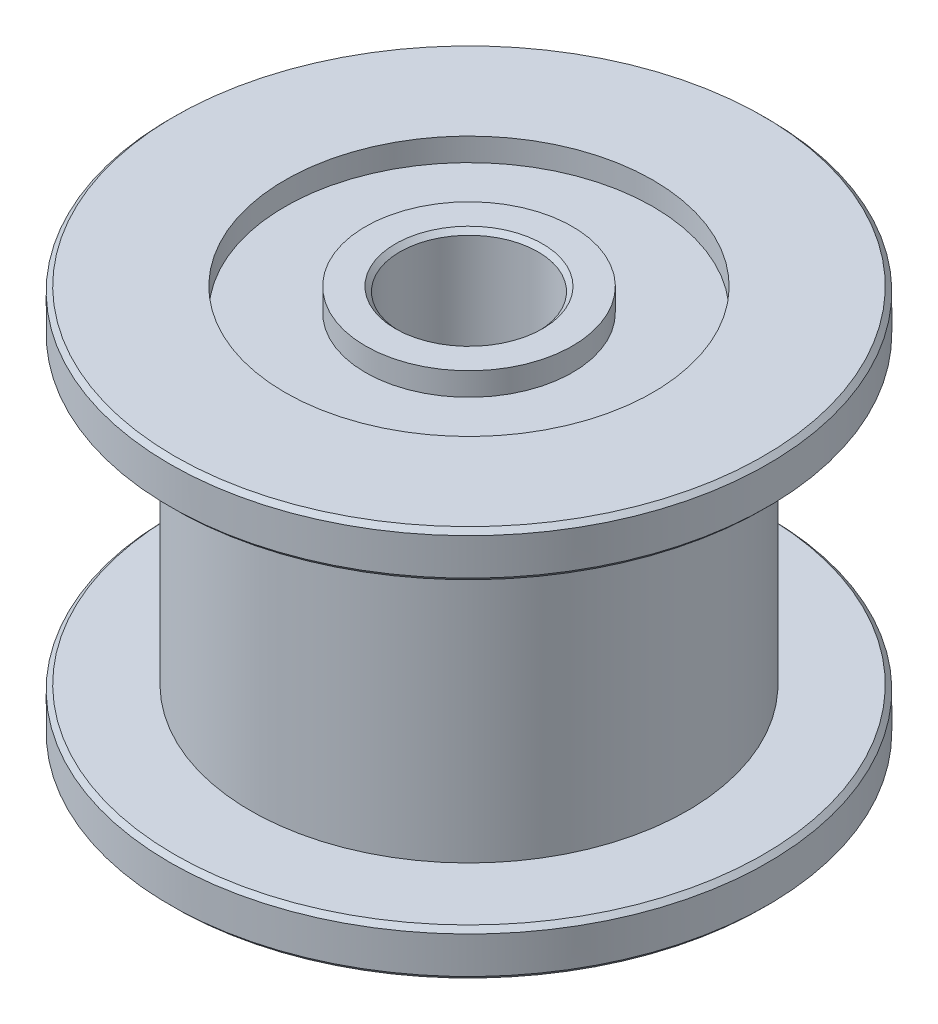
ISO-10303-21;
HEADER;
FILE_DESCRIPTION(('STEP AP214'),'2;1');
FILE_NAME('part.step','',(''),(''),'','','');
FILE_SCHEMA(('AUTOMOTIVE_DESIGN { 1 0 10303 214 1 1 1 1 }'));
ENDSEC;
DATA;
#1=APPLICATION_CONTEXT('core data for automotive mechanical design processes');
#2=APPLICATION_PROTOCOL_DEFINITION('international standard','automotive_design',2000,#1);
#3=PRODUCT_CONTEXT('',#1,'mechanical');
#4=PRODUCT('Part','Part','',(#3));
#5=PRODUCT_RELATED_PRODUCT_CATEGORY('part','',(#4));
#6=PRODUCT_DEFINITION_FORMATION('','',#4);
#7=PRODUCT_DEFINITION_CONTEXT('part definition',#1,'design');
#8=PRODUCT_DEFINITION('design','',#6,#7);
#9=PRODUCT_DEFINITION_SHAPE('','',#8);
#10=(LENGTH_UNIT() NAMED_UNIT(*) SI_UNIT(.MILLI.,.METRE.));
#11=(NAMED_UNIT(*) PLANE_ANGLE_UNIT() SI_UNIT($,.RADIAN.));
#12=(NAMED_UNIT(*) SI_UNIT($,.STERADIAN.) SOLID_ANGLE_UNIT());
#13=UNCERTAINTY_MEASURE_WITH_UNIT(LENGTH_MEASURE(1.E-05),#10,'distance_accuracy_value','');
#14=(GEOMETRIC_REPRESENTATION_CONTEXT(3) GLOBAL_UNCERTAINTY_ASSIGNED_CONTEXT((#13)) GLOBAL_UNIT_ASSIGNED_CONTEXT((#10,
#11,#12)) REPRESENTATION_CONTEXT('',''));
#15=CARTESIAN_POINT('',(0.,0.,0.));
#16=DIRECTION('',(0.,0.,1.));
#17=DIRECTION('',(1.,0.,0.));
#18=AXIS2_PLACEMENT_3D('',#15,#16,#17);
#19=CARTESIAN_POINT('',(0.,-4.25,-6.5));
#20=DIRECTION('',(0.,-1.,0.));
#21=DIRECTION('',(0.,0.,-1.));
#22=AXIS2_PLACEMENT_3D('',#19,#20,#21);
#23=PLANE('',#22);
#24=CARTESIAN_POINT('',(0.,-4.25,0.));
#25=DIRECTION('',(0.,-1.,0.));
#26=DIRECTION('',(0.,0.,-1.));
#27=AXIS2_PLACEMENT_3D('',#24,#25,#26);
#28=CIRCLE('',#27,1.6);
#29=CARTESIAN_POINT('',(0.,-4.25,-1.6));
#30=VERTEX_POINT('',#29);
#31=EDGE_CURVE('E57',#30,#30,#28,.F.);
#32=ORIENTED_EDGE('',*,*,#31,.T.);
#33=EDGE_LOOP('',(#32));
#34=FACE_BOUND('',#33,.T.);
#35=CARTESIAN_POINT('',(0.,-4.25,0.));
#36=DIRECTION('',(0.,1.,0.));
#37=DIRECTION('',(0.,0.,1.));
#38=AXIS2_PLACEMENT_3D('',#35,#36,#37);
#39=CIRCLE('',#38,2.25);
#40=CARTESIAN_POINT('',(0.,-4.25,2.25));
#41=VERTEX_POINT('',#40);
#42=EDGE_CURVE('E100',#41,#41,#39,.T.);
#43=ORIENTED_EDGE('',*,*,#42,.F.);
#44=EDGE_LOOP('',(#43));
#45=FACE_BOUND('',#44,.T.);
#46=ADVANCED_FACE('F31',(#34,#45),#23,.T.);
#47=CARTESIAN_POINT('',(0.,4.25,-1.5));
#48=DIRECTION('',(0.,1.,0.));
#49=DIRECTION('',(0.,0.,1.));
#50=AXIS2_PLACEMENT_3D('',#47,#48,#49);
#51=PLANE('',#50);
#52=CARTESIAN_POINT('',(0.,4.25,0.));
#53=DIRECTION('',(0.,1.,0.));
#54=DIRECTION('',(0.,0.,1.));
#55=AXIS2_PLACEMENT_3D('',#52,#53,#54);
#56=CIRCLE('',#55,1.6);
#57=CARTESIAN_POINT('',(0.,4.25,1.6));
#58=VERTEX_POINT('',#57);
#59=EDGE_CURVE('E69',#58,#58,#56,.F.);
#60=ORIENTED_EDGE('',*,*,#59,.T.);
#61=EDGE_LOOP('',(#60));
#62=FACE_BOUND('',#61,.T.);
#63=CARTESIAN_POINT('',(0.,4.25,0.));
#64=DIRECTION('',(0.,1.,0.));
#65=DIRECTION('',(0.,0.,1.));
#66=AXIS2_PLACEMENT_3D('',#63,#64,#65);
#67=CIRCLE('',#66,2.25);
#68=CARTESIAN_POINT('',(0.,4.25,2.25));
#69=VERTEX_POINT('',#68);
#70=EDGE_CURVE('E88',#69,#69,#67,.T.);
#71=ORIENTED_EDGE('',*,*,#70,.T.);
#72=EDGE_LOOP('',(#71));
#73=FACE_BOUND('',#72,.T.);
#74=ADVANCED_FACE('F116',(#62,#73),#51,.T.);
#75=CARTESIAN_POINT('',(0.,-4.25,0.));
#76=DIRECTION('',(0.,1.,0.));
#77=DIRECTION('',(0.,0.,1.));
#78=AXIS2_PLACEMENT_3D('',#75,#76,#77);
#79=CIRCLE('',#78,4.);
#80=CARTESIAN_POINT('',(0.,-4.25,4.));
#81=VERTEX_POINT('',#80);
#82=EDGE_CURVE('E94',#81,#81,#79,.T.);
#83=ORIENTED_EDGE('',*,*,#82,.T.);
#84=EDGE_LOOP('',(#83));
#85=FACE_BOUND('',#84,.T.);
#86=CARTESIAN_POINT('',(0.,-4.25,0.));
#87=DIRECTION('',(0.,-1.,0.));
#88=DIRECTION('',(0.,0.,-1.));
#89=AXIS2_PLACEMENT_3D('',#86,#87,#88);
#90=CIRCLE('',#89,6.4);
#91=CARTESIAN_POINT('',(0.,-4.25,-6.4));
#92=VERTEX_POINT('',#91);
#93=EDGE_CURVE('E60',#92,#92,#90,.T.);
#94=ORIENTED_EDGE('',*,*,#93,.T.);
#95=EDGE_LOOP('',(#94));
#96=FACE_BOUND('',#95,.T.);
#97=ADVANCED_FACE('F119',(#85,#96),#23,.T.);
#98=CARTESIAN_POINT('',(0.,0.,0.));
#99=DIRECTION('',(0.,-1.,0.));
#100=DIRECTION('',(0.,0.,-1.));
#101=AXIS2_PLACEMENT_3D('',#98,#99,#100);
#102=CYLINDRICAL_SURFACE('',#101,1.5);
#103=CARTESIAN_POINT('',(0.,4.15,0.));
#104=DIRECTION('',(0.,1.,0.));
#105=DIRECTION('',(0.,0.,1.));
#106=AXIS2_PLACEMENT_3D('',#103,#104,#105);
#107=CIRCLE('',#106,1.5);
#108=CARTESIAN_POINT('',(0.,4.15,1.5));
#109=VERTEX_POINT('',#108);
#110=EDGE_CURVE('E63',#109,#109,#107,.T.);
#111=ORIENTED_EDGE('',*,*,#110,.T.);
#112=EDGE_LOOP('',(#111));
#113=FACE_BOUND('',#112,.T.);
#114=CARTESIAN_POINT('',(0.,-4.15,0.));
#115=DIRECTION('',(0.,-1.,0.));
#116=DIRECTION('',(0.,0.,-1.));
#117=AXIS2_PLACEMENT_3D('',#114,#115,#116);
#118=CIRCLE('',#117,1.5);
#119=CARTESIAN_POINT('',(0.,-4.15,-1.5));
#120=VERTEX_POINT('',#119);
#121=EDGE_CURVE('E66',#120,#120,#118,.T.);
#122=ORIENTED_EDGE('',*,*,#121,.T.);
#123=EDGE_LOOP('',(#122));
#124=FACE_BOUND('',#123,.T.);
#125=ADVANCED_FACE('F129',(#113,#124),#102,.F.);
#126=CARTESIAN_POINT('',(0.,4.25,0.));
#127=DIRECTION('',(0.,1.,0.));
#128=DIRECTION('',(0.,0.,1.));
#129=AXIS2_PLACEMENT_3D('',#126,#127,#128);
#130=CIRCLE('',#129,4.);
#131=CARTESIAN_POINT('',(0.,4.25,4.));
#132=VERTEX_POINT('',#131);
#133=EDGE_CURVE('E82',#132,#132,#130,.T.);
#134=ORIENTED_EDGE('',*,*,#133,.F.);
#135=EDGE_LOOP('',(#134));
#136=FACE_BOUND('',#135,.T.);
#137=CARTESIAN_POINT('',(0.,4.25,0.));
#138=DIRECTION('',(0.,1.,0.));
#139=DIRECTION('',(0.,0.,1.));
#140=AXIS2_PLACEMENT_3D('',#137,#138,#139);
#141=CIRCLE('',#140,6.4);
#142=CARTESIAN_POINT('',(0.,4.25,6.4));
#143=VERTEX_POINT('',#142);
#144=EDGE_CURVE('E72',#143,#143,#141,.T.);
#145=ORIENTED_EDGE('',*,*,#144,.T.);
#146=EDGE_LOOP('',(#145));
#147=FACE_BOUND('',#146,.T.);
#148=ADVANCED_FACE('F125',(#136,#147),#51,.T.);
#149=CARTESIAN_POINT('',(0.,0.,0.));
#150=DIRECTION('',(0.,-1.,0.));
#151=DIRECTION('',(0.,0.,-1.));
#152=AXIS2_PLACEMENT_3D('',#149,#150,#151);
#153=CYLINDRICAL_SURFACE('',#152,6.5);
#154=CARTESIAN_POINT('',(0.,3.35,0.));
#155=DIRECTION('',(0.,-1.,0.));
#156=DIRECTION('',(0.,0.,-1.));
#157=AXIS2_PLACEMENT_3D('',#154,#155,#156);
#158=CIRCLE('',#157,6.5);
#159=CARTESIAN_POINT('',(0.,3.35,-6.5));
#160=VERTEX_POINT('',#159);
#161=EDGE_CURVE('E10',#160,#160,#158,.F.);
#162=ORIENTED_EDGE('',*,*,#161,.T.);
#163=EDGE_LOOP('',(#162));
#164=FACE_BOUND('',#163,.T.);
#165=CARTESIAN_POINT('',(0.,4.15,0.));
#166=DIRECTION('',(0.,1.,0.));
#167=DIRECTION('',(0.,0.,1.));
#168=AXIS2_PLACEMENT_3D('',#165,#166,#167);
#169=CIRCLE('',#168,6.5);
#170=CARTESIAN_POINT('',(0.,4.15,6.5));
#171=VERTEX_POINT('',#170);
#172=EDGE_CURVE('E38',#171,#171,#169,.F.);
#173=ORIENTED_EDGE('',*,*,#172,.T.);
#174=EDGE_LOOP('',(#173));
#175=FACE_BOUND('',#174,.T.);
#176=ADVANCED_FACE('F170',(#164,#175),#153,.T.);
#177=CARTESIAN_POINT('',(0.,3.25,-6.5));
#178=DIRECTION('',(0.,-1.,0.));
#179=DIRECTION('',(0.,0.,-1.));
#180=AXIS2_PLACEMENT_3D('',#177,#178,#179);
#181=PLANE('',#180);
#182=CARTESIAN_POINT('',(0.,3.25,0.));
#183=DIRECTION('',(0.,-1.,0.));
#184=DIRECTION('',(0.,0.,-1.));
#185=AXIS2_PLACEMENT_3D('',#182,#183,#184);
#186=CIRCLE('',#185,6.4);
#187=CARTESIAN_POINT('',(0.,3.25,-6.4));
#188=VERTEX_POINT('',#187);
#189=EDGE_CURVE('E42',#188,#188,#186,.T.);
#190=ORIENTED_EDGE('',*,*,#189,.T.);
#191=EDGE_LOOP('',(#190));
#192=FACE_BOUND('',#191,.T.);
#193=CARTESIAN_POINT('',(0.,3.25,0.));
#194=DIRECTION('',(0.,-1.,0.));
#195=DIRECTION('',(0.,0.,-1.));
#196=AXIS2_PLACEMENT_3D('',#193,#194,#195);
#197=CIRCLE('',#196,4.75);
#198=CARTESIAN_POINT('',(0.,3.25,-4.75));
#199=VERTEX_POINT('',#198);
#200=EDGE_CURVE('E75',#199,#199,#197,.T.);
#201=ORIENTED_EDGE('',*,*,#200,.F.);
#202=EDGE_LOOP('',(#201));
#203=FACE_BOUND('',#202,.T.);
#204=ADVANCED_FACE('F166',(#192,#203),#181,.T.);
#205=CARTESIAN_POINT('',(0.,0.,0.));
#206=DIRECTION('',(0.,-1.,0.));
#207=DIRECTION('',(0.,0.,-1.));
#208=AXIS2_PLACEMENT_3D('',#205,#206,#207);
#209=CYLINDRICAL_SURFACE('',#208,4.75);
#210=ORIENTED_EDGE('',*,*,#200,.T.);
#211=EDGE_LOOP('',(#210));
#212=FACE_BOUND('',#211,.T.);
#213=CARTESIAN_POINT('',(0.,-3.25,0.));
#214=DIRECTION('',(0.,-1.,0.));
#215=DIRECTION('',(0.,0.,-1.));
#216=AXIS2_PLACEMENT_3D('',#213,#214,#215);
#217=CIRCLE('',#216,4.75);
#218=CARTESIAN_POINT('',(0.,-3.25,-4.75));
#219=VERTEX_POINT('',#218);
#220=EDGE_CURVE('E78',#219,#219,#217,.T.);
#221=ORIENTED_EDGE('',*,*,#220,.F.);
#222=EDGE_LOOP('',(#221));
#223=FACE_BOUND('',#222,.T.);
#224=ADVANCED_FACE('F169',(#212,#223),#209,.T.);
#225=CARTESIAN_POINT('',(0.,-3.25,-4.75));
#226=DIRECTION('',(0.,1.,0.));
#227=DIRECTION('',(0.,0.,1.));
#228=AXIS2_PLACEMENT_3D('',#225,#226,#227);
#229=PLANE('',#228);
#230=CARTESIAN_POINT('',(0.,-3.25,0.));
#231=DIRECTION('',(0.,1.,0.));
#232=DIRECTION('',(0.,0.,1.));
#233=AXIS2_PLACEMENT_3D('',#230,#231,#232);
#234=CIRCLE('',#233,6.4);
#235=CARTESIAN_POINT('',(0.,-3.25,6.4));
#236=VERTEX_POINT('',#235);
#237=EDGE_CURVE('E46',#236,#236,#234,.T.);
#238=ORIENTED_EDGE('',*,*,#237,.T.);
#239=EDGE_LOOP('',(#238));
#240=FACE_BOUND('',#239,.T.);
#241=ORIENTED_EDGE('',*,*,#220,.T.);
#242=EDGE_LOOP('',(#241));
#243=FACE_BOUND('',#242,.T.);
#244=ADVANCED_FACE('F176',(#240,#243),#229,.T.);
#245=CARTESIAN_POINT('',(0.,0.,0.));
#246=DIRECTION('',(0.,-1.,0.));
#247=DIRECTION('',(0.,0.,-1.));
#248=AXIS2_PLACEMENT_3D('',#245,#246,#247);
#249=CYLINDRICAL_SURFACE('',#248,6.5);
#250=CARTESIAN_POINT('',(0.,-4.15,0.));
#251=DIRECTION('',(0.,-1.,0.));
#252=DIRECTION('',(0.,0.,-1.));
#253=AXIS2_PLACEMENT_3D('',#250,#251,#252);
#254=CIRCLE('',#253,6.5);
#255=CARTESIAN_POINT('',(0.,-4.15,-6.5));
#256=VERTEX_POINT('',#255);
#257=EDGE_CURVE('E51',#256,#256,#254,.F.);
#258=ORIENTED_EDGE('',*,*,#257,.T.);
#259=EDGE_LOOP('',(#258));
#260=FACE_BOUND('',#259,.T.);
#261=CARTESIAN_POINT('',(0.,-3.35,0.));
#262=DIRECTION('',(0.,1.,0.));
#263=DIRECTION('',(0.,0.,1.));
#264=AXIS2_PLACEMENT_3D('',#261,#262,#263);
#265=CIRCLE('',#264,6.5);
#266=CARTESIAN_POINT('',(0.,-3.35,6.5));
#267=VERTEX_POINT('',#266);
#268=EDGE_CURVE('E54',#267,#267,#265,.F.);
#269=ORIENTED_EDGE('',*,*,#268,.T.);
#270=EDGE_LOOP('',(#269));
#271=FACE_BOUND('',#270,.T.);
#272=ADVANCED_FACE('F181',(#260,#271),#249,.T.);
#273=CARTESIAN_POINT('',(0.,4.25,0.));
#274=DIRECTION('',(0.,1.,0.));
#275=DIRECTION('',(0.,0.,1.));
#276=AXIS2_PLACEMENT_3D('',#273,#274,#275);
#277=CONICAL_SURFACE('',#276,1.6,0.785398163397438);
#278=ORIENTED_EDGE('',*,*,#110,.F.);
#279=EDGE_LOOP('',(#278));
#280=FACE_BOUND('',#279,.T.);
#281=ORIENTED_EDGE('',*,*,#59,.F.);
#282=EDGE_LOOP('',(#281));
#283=FACE_BOUND('',#282,.T.);
#284=ADVANCED_FACE('F152',(#280,#283),#277,.F.);
#285=CARTESIAN_POINT('',(0.,-4.15,0.));
#286=DIRECTION('',(0.,-1.,0.));
#287=DIRECTION('',(0.,0.,-1.));
#288=AXIS2_PLACEMENT_3D('',#285,#286,#287);
#289=CONICAL_SURFACE('',#288,1.5,0.785398163397441);
#290=ORIENTED_EDGE('',*,*,#31,.F.);
#291=EDGE_LOOP('',(#290));
#292=FACE_BOUND('',#291,.T.);
#293=ORIENTED_EDGE('',*,*,#121,.F.);
#294=EDGE_LOOP('',(#293));
#295=FACE_BOUND('',#294,.T.);
#296=ADVANCED_FACE('F142',(#292,#295),#289,.F.);
#297=CARTESIAN_POINT('',(0.,-4.25,0.));
#298=DIRECTION('',(0.,1.,0.));
#299=DIRECTION('',(0.,0.,1.));
#300=AXIS2_PLACEMENT_3D('',#297,#298,#299);
#301=CONICAL_SURFACE('',#300,6.4,0.785398163397453);
#302=ORIENTED_EDGE('',*,*,#257,.F.);
#303=EDGE_LOOP('',(#302));
#304=FACE_BOUND('',#303,.T.);
#305=ORIENTED_EDGE('',*,*,#93,.F.);
#306=EDGE_LOOP('',(#305));
#307=FACE_BOUND('',#306,.T.);
#308=ADVANCED_FACE('F139',(#304,#307),#301,.T.);
#309=CARTESIAN_POINT('',(0.,-3.35,0.));
#310=DIRECTION('',(0.,-1.,0.));
#311=DIRECTION('',(0.,0.,-1.));
#312=AXIS2_PLACEMENT_3D('',#309,#310,#311);
#313=CONICAL_SURFACE('',#312,6.5,0.785398163397457);
#314=ORIENTED_EDGE('',*,*,#237,.F.);
#315=EDGE_LOOP('',(#314));
#316=FACE_BOUND('',#315,.T.);
#317=ORIENTED_EDGE('',*,*,#268,.F.);
#318=EDGE_LOOP('',(#317));
#319=FACE_BOUND('',#318,.T.);
#320=ADVANCED_FACE('F141',(#316,#319),#313,.T.);
#321=CARTESIAN_POINT('',(0.,3.25,0.));
#322=DIRECTION('',(0.,1.,0.));
#323=DIRECTION('',(0.,0.,1.));
#324=AXIS2_PLACEMENT_3D('',#321,#322,#323);
#325=CONICAL_SURFACE('',#324,6.4,0.785398163397453);
#326=ORIENTED_EDGE('',*,*,#161,.F.);
#327=EDGE_LOOP('',(#326));
#328=FACE_BOUND('',#327,.T.);
#329=ORIENTED_EDGE('',*,*,#189,.F.);
#330=EDGE_LOOP('',(#329));
#331=FACE_BOUND('',#330,.T.);
#332=ADVANCED_FACE('F149',(#328,#331),#325,.T.);
#333=CARTESIAN_POINT('',(0.,4.15,0.));
#334=DIRECTION('',(0.,-1.,0.));
#335=DIRECTION('',(0.,0.,-1.));
#336=AXIS2_PLACEMENT_3D('',#333,#334,#335);
#337=CONICAL_SURFACE('',#336,6.5,0.78539816339744);
#338=ORIENTED_EDGE('',*,*,#144,.F.);
#339=EDGE_LOOP('',(#338));
#340=FACE_BOUND('',#339,.T.);
#341=ORIENTED_EDGE('',*,*,#172,.F.);
#342=EDGE_LOOP('',(#341));
#343=FACE_BOUND('',#342,.T.);
#344=ADVANCED_FACE('F33',(#340,#343),#337,.T.);
#345=CARTESIAN_POINT('',(0.,3.75,0.));
#346=DIRECTION('',(0.,1.,0.));
#347=DIRECTION('',(0.,0.,1.));
#348=AXIS2_PLACEMENT_3D('',#345,#346,#347);
#349=CYLINDRICAL_SURFACE('',#348,4.);
#350=CARTESIAN_POINT('',(0.,3.75,0.));
#351=DIRECTION('',(0.,1.,0.));
#352=DIRECTION('',(0.,0.,1.));
#353=AXIS2_PLACEMENT_3D('',#350,#351,#352);
#354=CIRCLE('',#353,4.);
#355=CARTESIAN_POINT('',(0.,3.75,4.));
#356=VERTEX_POINT('',#355);
#357=EDGE_CURVE('E81',#356,#356,#354,.T.);
#358=ORIENTED_EDGE('',*,*,#357,.F.);
#359=EDGE_LOOP('',(#358));
#360=FACE_BOUND('',#359,.T.);
#361=ORIENTED_EDGE('',*,*,#133,.T.);
#362=EDGE_LOOP('',(#361));
#363=FACE_BOUND('',#362,.T.);
#364=ADVANCED_FACE('F161',(#360,#363),#349,.F.);
#365=CARTESIAN_POINT('',(0.,3.75,0.));
#366=DIRECTION('',(0.,1.,0.));
#367=DIRECTION('',(0.,0.,1.));
#368=AXIS2_PLACEMENT_3D('',#365,#366,#367);
#369=PLANE('',#368);
#370=CARTESIAN_POINT('',(0.,3.75,0.));
#371=DIRECTION('',(0.,1.,0.));
#372=DIRECTION('',(0.,0.,1.));
#373=AXIS2_PLACEMENT_3D('',#370,#371,#372);
#374=CIRCLE('',#373,2.25);
#375=CARTESIAN_POINT('',(0.,3.75,2.25));
#376=VERTEX_POINT('',#375);
#377=EDGE_CURVE('E85',#376,#376,#374,.T.);
#378=ORIENTED_EDGE('',*,*,#377,.F.);
#379=EDGE_LOOP('',(#378));
#380=FACE_BOUND('',#379,.T.);
#381=ORIENTED_EDGE('',*,*,#357,.T.);
#382=EDGE_LOOP('',(#381));
#383=FACE_BOUND('',#382,.T.);
#384=ADVANCED_FACE('F202',(#380,#383),#369,.T.);
#385=CARTESIAN_POINT('',(0.,3.75,0.));
#386=DIRECTION('',(0.,1.,0.));
#387=DIRECTION('',(0.,0.,1.));
#388=AXIS2_PLACEMENT_3D('',#385,#386,#387);
#389=CYLINDRICAL_SURFACE('',#388,2.25);
#390=ORIENTED_EDGE('',*,*,#377,.T.);
#391=EDGE_LOOP('',(#390));
#392=FACE_BOUND('',#391,.T.);
#393=ORIENTED_EDGE('',*,*,#70,.F.);
#394=EDGE_LOOP('',(#393));
#395=FACE_BOUND('',#394,.T.);
#396=ADVANCED_FACE('F207',(#392,#395),#389,.T.);
#397=CARTESIAN_POINT('',(0.,-3.75,0.));
#398=DIRECTION('',(0.,-1.,0.));
#399=DIRECTION('',(0.,0.,1.));
#400=AXIS2_PLACEMENT_3D('',#397,#398,#399);
#401=PLANE('',#400);
#402=CARTESIAN_POINT('',(0.,-3.75,0.));
#403=DIRECTION('',(0.,1.,0.));
#404=DIRECTION('',(0.,0.,1.));
#405=AXIS2_PLACEMENT_3D('',#402,#403,#404);
#406=CIRCLE('',#405,4.);
#407=CARTESIAN_POINT('',(0.,-3.75,4.));
#408=VERTEX_POINT('',#407);
#409=EDGE_CURVE('E91',#408,#408,#406,.T.);
#410=ORIENTED_EDGE('',*,*,#409,.F.);
#411=EDGE_LOOP('',(#410));
#412=FACE_BOUND('',#411,.T.);
#413=CARTESIAN_POINT('',(0.,-3.75,0.));
#414=DIRECTION('',(0.,1.,0.));
#415=DIRECTION('',(0.,0.,1.));
#416=AXIS2_PLACEMENT_3D('',#413,#414,#415);
#417=CIRCLE('',#416,2.25);
#418=CARTESIAN_POINT('',(0.,-3.75,2.25));
#419=VERTEX_POINT('',#418);
#420=EDGE_CURVE('E97',#419,#419,#417,.T.);
#421=ORIENTED_EDGE('',*,*,#420,.T.);
#422=EDGE_LOOP('',(#421));
#423=FACE_BOUND('',#422,.T.);
#424=ADVANCED_FACE('F106',(#412,#423),#401,.T.);
#425=CARTESIAN_POINT('',(0.,-3.75,0.));
#426=DIRECTION('',(0.,-1.,0.));
#427=DIRECTION('',(0.,0.,-1.));
#428=AXIS2_PLACEMENT_3D('',#425,#426,#427);
#429=CYLINDRICAL_SURFACE('',#428,4.);
#430=ORIENTED_EDGE('',*,*,#409,.T.);
#431=EDGE_LOOP('',(#430));
#432=FACE_BOUND('',#431,.T.);
#433=ORIENTED_EDGE('',*,*,#82,.F.);
#434=EDGE_LOOP('',(#433));
#435=FACE_BOUND('',#434,.T.);
#436=ADVANCED_FACE('F111',(#432,#435),#429,.F.);
#437=CARTESIAN_POINT('',(0.,-3.75,0.));
#438=DIRECTION('',(0.,-1.,0.));
#439=DIRECTION('',(0.,0.,-1.));
#440=AXIS2_PLACEMENT_3D('',#437,#438,#439);
#441=CYLINDRICAL_SURFACE('',#440,2.25);
#442=ORIENTED_EDGE('',*,*,#420,.F.);
#443=EDGE_LOOP('',(#442));
#444=FACE_BOUND('',#443,.T.);
#445=ORIENTED_EDGE('',*,*,#42,.T.);
#446=EDGE_LOOP('',(#445));
#447=FACE_BOUND('',#446,.T.);
#448=ADVANCED_FACE('F108',(#444,#447),#441,.T.);
#449=CLOSED_SHELL('',(#46,#74,#97,#125,#148,#176,#204,#224,#244,#272,#284,#296,#308,#320,#332,
#344,#364,#384,#396,#424,#436,#448));
#450=MANIFOLD_SOLID_BREP('B2',#449);
#451=ADVANCED_BREP_SHAPE_REPRESENTATION('',(#18,#450),#14);
#452=SHAPE_DEFINITION_REPRESENTATION(#9,#451);
ENDSEC;
END-ISO-10303-21;
